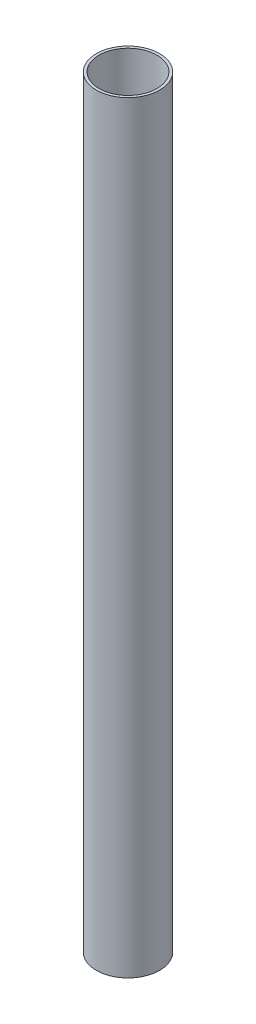
ISO-10303-21;
HEADER;
FILE_DESCRIPTION(('STEP AP214'),'2;1');
FILE_NAME('part.step','',(''),(''),'','','');
FILE_SCHEMA(('AUTOMOTIVE_DESIGN { 1 0 10303 214 1 1 1 1 }'));
ENDSEC;
DATA;
#1=APPLICATION_CONTEXT('core data for automotive mechanical design processes');
#2=APPLICATION_PROTOCOL_DEFINITION('international standard','automotive_design',2000,#1);
#3=PRODUCT_CONTEXT('',#1,'mechanical');
#4=PRODUCT('Part','Part','',(#3));
#5=PRODUCT_RELATED_PRODUCT_CATEGORY('part','',(#4));
#6=PRODUCT_DEFINITION_FORMATION('','',#4);
#7=PRODUCT_DEFINITION_CONTEXT('part definition',#1,'design');
#8=PRODUCT_DEFINITION('design','',#6,#7);
#9=PRODUCT_DEFINITION_SHAPE('','',#8);
#10=(LENGTH_UNIT() NAMED_UNIT(*) SI_UNIT(.MILLI.,.METRE.));
#11=(NAMED_UNIT(*) PLANE_ANGLE_UNIT() SI_UNIT($,.RADIAN.));
#12=(NAMED_UNIT(*) SI_UNIT($,.STERADIAN.) SOLID_ANGLE_UNIT());
#13=UNCERTAINTY_MEASURE_WITH_UNIT(LENGTH_MEASURE(1.E-05),#10,'distance_accuracy_value','');
#14=(GEOMETRIC_REPRESENTATION_CONTEXT(3) GLOBAL_UNCERTAINTY_ASSIGNED_CONTEXT((#13)) GLOBAL_UNIT_ASSIGNED_CONTEXT((#10,
#11,#12)) REPRESENTATION_CONTEXT('',''));
#15=CARTESIAN_POINT('',(0.,0.,0.));
#16=DIRECTION('',(0.,0.,1.));
#17=DIRECTION('',(1.,0.,0.));
#18=AXIS2_PLACEMENT_3D('',#15,#16,#17);
#19=CARTESIAN_POINT('',(0.,1000.,0.));
#20=DIRECTION('',(0.,1.,0.));
#21=DIRECTION('',(0.,0.,1.));
#22=AXIS2_PLACEMENT_3D('',#19,#20,#21);
#23=PLANE('',#22);
#24=CARTESIAN_POINT('',(0.,1000.,0.));
#25=DIRECTION('',(0.,1.,0.));
#26=DIRECTION('',(0.,0.,1.));
#27=AXIS2_PLACEMENT_3D('',#24,#25,#26);
#28=CIRCLE('',#27,41.5);
#29=CARTESIAN_POINT('',(0.,1000.,41.5));
#30=VERTEX_POINT('',#29);
#31=EDGE_CURVE('E10',#30,#30,#28,.T.);
#32=ORIENTED_EDGE('',*,*,#31,.T.);
#33=EDGE_LOOP('',(#32));
#34=FACE_BOUND('',#33,.T.);
#35=CARTESIAN_POINT('',(0.,1000.,0.));
#36=DIRECTION('',(0.,1.,0.));
#37=DIRECTION('',(0.,0.,1.));
#38=AXIS2_PLACEMENT_3D('',#35,#36,#37);
#39=CIRCLE('',#38,38.);
#40=CARTESIAN_POINT('',(0.,1000.,38.));
#41=VERTEX_POINT('',#40);
#42=EDGE_CURVE('E53',#41,#41,#39,.T.);
#43=ORIENTED_EDGE('',*,*,#42,.F.);
#44=EDGE_LOOP('',(#43));
#45=FACE_BOUND('',#44,.T.);
#46=ADVANCED_FACE('F42',(#34,#45),#23,.T.);
#47=CARTESIAN_POINT('',(0.,0.,0.));
#48=DIRECTION('',(0.,1.,0.));
#49=DIRECTION('',(0.,0.,1.));
#50=AXIS2_PLACEMENT_3D('',#47,#48,#49);
#51=PLANE('',#50);
#52=CARTESIAN_POINT('',(0.,0.,0.));
#53=DIRECTION('',(0.,1.,0.));
#54=DIRECTION('',(0.,0.,1.));
#55=AXIS2_PLACEMENT_3D('',#52,#53,#54);
#56=CIRCLE('',#55,41.5);
#57=CARTESIAN_POINT('',(0.,0.,41.5));
#58=VERTEX_POINT('',#57);
#59=EDGE_CURVE('E46',#58,#58,#56,.T.);
#60=ORIENTED_EDGE('',*,*,#59,.F.);
#61=EDGE_LOOP('',(#60));
#62=FACE_BOUND('',#61,.T.);
#63=CARTESIAN_POINT('',(0.,0.,0.));
#64=DIRECTION('',(0.,1.,0.));
#65=DIRECTION('',(0.,0.,1.));
#66=AXIS2_PLACEMENT_3D('',#63,#64,#65);
#67=CIRCLE('',#66,38.);
#68=CARTESIAN_POINT('',(0.,0.,38.));
#69=VERTEX_POINT('',#68);
#70=EDGE_CURVE('E55',#69,#69,#67,.T.);
#71=ORIENTED_EDGE('',*,*,#70,.T.);
#72=EDGE_LOOP('',(#71));
#73=FACE_BOUND('',#72,.T.);
#74=ADVANCED_FACE('F65',(#62,#73),#51,.F.);
#75=CARTESIAN_POINT('',(0.,1000.,0.));
#76=DIRECTION('',(0.,-1.,0.));
#77=DIRECTION('',(0.,0.,-1.));
#78=AXIS2_PLACEMENT_3D('',#75,#76,#77);
#79=CYLINDRICAL_SURFACE('',#78,41.5);
#80=ORIENTED_EDGE('',*,*,#31,.F.);
#81=EDGE_LOOP('',(#80));
#82=FACE_BOUND('',#81,.T.);
#83=ORIENTED_EDGE('',*,*,#59,.T.);
#84=EDGE_LOOP('',(#83));
#85=FACE_BOUND('',#84,.T.);
#86=ADVANCED_FACE('F44',(#82,#85),#79,.T.);
#87=CARTESIAN_POINT('',(0.,1000.,0.));
#88=DIRECTION('',(0.,-1.,0.));
#89=DIRECTION('',(0.,0.,-1.));
#90=AXIS2_PLACEMENT_3D('',#87,#88,#89);
#91=CYLINDRICAL_SURFACE('',#90,38.);
#92=ORIENTED_EDGE('',*,*,#42,.T.);
#93=EDGE_LOOP('',(#92));
#94=FACE_BOUND('',#93,.T.);
#95=ORIENTED_EDGE('',*,*,#70,.F.);
#96=EDGE_LOOP('',(#95));
#97=FACE_BOUND('',#96,.T.);
#98=ADVANCED_FACE('F61',(#94,#97),#91,.F.);
#99=CLOSED_SHELL('',(#46,#74,#86,#98));
#100=MANIFOLD_SOLID_BREP('B2',#99);
#101=ADVANCED_BREP_SHAPE_REPRESENTATION('',(#18,#100),#14);
#102=SHAPE_DEFINITION_REPRESENTATION(#9,#101);
ENDSEC;
END-ISO-10303-21;
